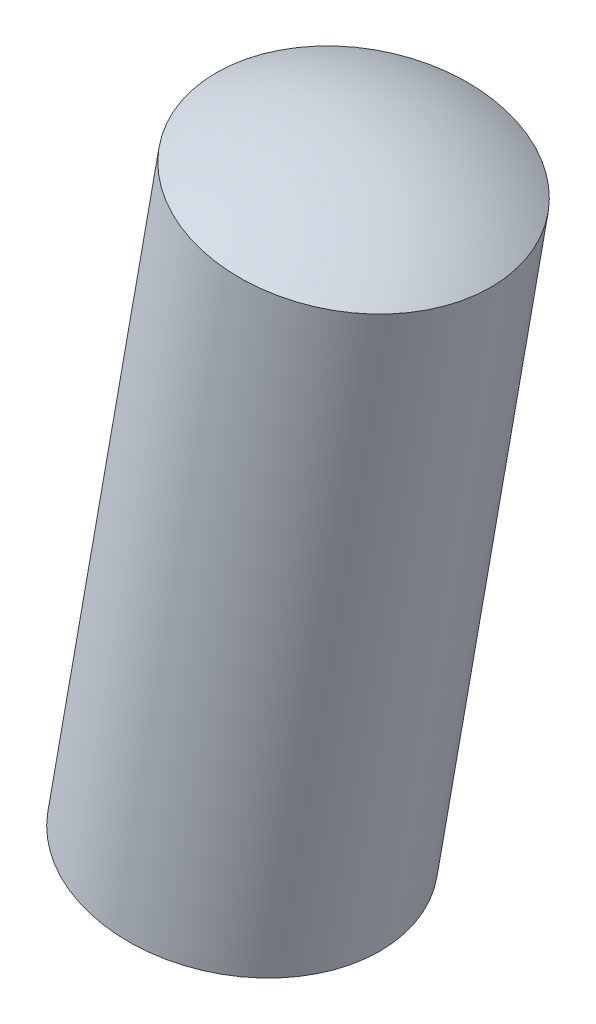
ISO-10303-21;
HEADER;
FILE_DESCRIPTION(('STEP AP214'),'2;1');
FILE_NAME('part.step','',(''),(''),'','','');
FILE_SCHEMA(('AUTOMOTIVE_DESIGN { 1 0 10303 214 1 1 1 1 }'));
ENDSEC;
DATA;
#1=APPLICATION_CONTEXT('core data for automotive mechanical design processes');
#2=APPLICATION_PROTOCOL_DEFINITION('international standard','automotive_design',2000,#1);
#3=PRODUCT_CONTEXT('',#1,'mechanical');
#4=PRODUCT('Part','Part','',(#3));
#5=PRODUCT_RELATED_PRODUCT_CATEGORY('part','',(#4));
#6=PRODUCT_DEFINITION_FORMATION('','',#4);
#7=PRODUCT_DEFINITION_CONTEXT('part definition',#1,'design');
#8=PRODUCT_DEFINITION('design','',#6,#7);
#9=PRODUCT_DEFINITION_SHAPE('','',#8);
#10=(LENGTH_UNIT() NAMED_UNIT(*) SI_UNIT(.MILLI.,.METRE.));
#11=(NAMED_UNIT(*) PLANE_ANGLE_UNIT() SI_UNIT($,.RADIAN.));
#12=(NAMED_UNIT(*) SI_UNIT($,.STERADIAN.) SOLID_ANGLE_UNIT());
#13=UNCERTAINTY_MEASURE_WITH_UNIT(LENGTH_MEASURE(1.E-05),#10,'distance_accuracy_value','');
#14=(GEOMETRIC_REPRESENTATION_CONTEXT(3) GLOBAL_UNCERTAINTY_ASSIGNED_CONTEXT((#13)) GLOBAL_UNIT_ASSIGNED_CONTEXT((#10,
#11,#12)) REPRESENTATION_CONTEXT('',''));
#15=CARTESIAN_POINT('',(0.,0.,0.));
#16=DIRECTION('',(0.,0.,1.));
#17=DIRECTION('',(1.,0.,0.));
#18=AXIS2_PLACEMENT_3D('',#15,#16,#17);
#19=CARTESIAN_POINT('',(3.87168311793416,21.9744800051858,0.6));
#20=DIRECTION('',(0.984830818000518,-0.173517318779514,0.));
#21=DIRECTION('',(0.173517318779515,0.984830818000517,0.));
#22=AXIS2_PLACEMENT_3D('',#19,#20,#21);
#23=SPHERICAL_SURFACE('',#22,2.);
#24=CARTESIAN_POINT('',(3.87168311793416,21.9744800051858,0.6));
#25=DIRECTION('',(-0.173517318779515,-0.984830818000518,0.));
#26=DIRECTION('',(0.,0.,-1.));
#27=AXIS2_PLACEMENT_3D('',#24,#25,#26);
#28=SPHERICAL_SURFACE('',#27,2.);
#29=CARTESIAN_POINT('',(4.17222393005341,23.6802570188223,0.6));
#30=DIRECTION('',(-0.173517318779515,-0.984830818000517,0.));
#31=DIRECTION('',(0.,0.,-1.));
#32=AXIS2_PLACEMENT_3D('',#29,#30,#31);
#33=CIRCLE('',#32,1.);
#34=CARTESIAN_POINT('',(4.17222393005341,23.6802570188223,-0.4));
#35=VERTEX_POINT('',#34);
#36=EDGE_CURVE('E11',#35,#35,#33,.T.);
#37=ORIENTED_EDGE('',*,*,#36,.F.);
#38=EDGE_LOOP('',(#37));
#39=FACE_BOUND('',#38,.T.);
#40=ADVANCED_FACE('F17',(#39),#28,.T.);
#41=CARTESIAN_POINT('',(3.67632024897473,20.8656605778366,0.6));
#42=DIRECTION('',(0.984830818000518,-0.173517318779514,0.));
#43=DIRECTION('',(-0.173517318779514,-0.984830818000518,0.));
#44=AXIS2_PLACEMENT_3D('',#41,#42,#43);
#45=SPHERICAL_SURFACE('',#44,2.);
#46=CARTESIAN_POINT('',(3.67632024897473,20.8656605778366,0.6));
#47=DIRECTION('',(-0.173517318779515,-0.984830818000518,0.));
#48=DIRECTION('',(0.,0.,-1.));
#49=AXIS2_PLACEMENT_3D('',#46,#47,#48);
#50=SPHERICAL_SURFACE('',#49,2.);
#51=CARTESIAN_POINT('',(3.37577943685548,19.1598835642001,0.6));
#52=DIRECTION('',(-0.173517318779515,-0.984830818000517,0.));
#53=DIRECTION('',(0.,0.,-1.));
#54=AXIS2_PLACEMENT_3D('',#51,#52,#53);
#55=CIRCLE('',#54,1.);
#56=CARTESIAN_POINT('',(3.37577943685548,19.1598835642001,-0.4));
#57=VERTEX_POINT('',#56);
#58=EDGE_CURVE('E21',#57,#57,#55,.T.);
#59=ORIENTED_EDGE('',*,*,#58,.T.);
#60=EDGE_LOOP('',(#59));
#61=FACE_BOUND('',#60,.T.);
#62=ADVANCED_FACE('F19',(#61),#50,.T.);
#63=CARTESIAN_POINT('',(3.57489056015493,20.2899769278558,0.6));
#64=DIRECTION('',(-0.173517318779515,-0.984830818000517,0.));
#65=DIRECTION('',(0.,0.,-1.));
#66=AXIS2_PLACEMENT_3D('',#63,#64,#65);
#67=CYLINDRICAL_SURFACE('',#66,1.);
#68=ORIENTED_EDGE('',*,*,#36,.T.);
#69=EDGE_LOOP('',(#68));
#70=FACE_BOUND('',#69,.T.);
#71=ORIENTED_EDGE('',*,*,#58,.F.);
#72=EDGE_LOOP('',(#71));
#73=FACE_BOUND('',#72,.T.);
#74=ADVANCED_FACE('F57',(#70,#73),#67,.T.);
#75=CLOSED_SHELL('',(#40,#62,#74));
#76=MANIFOLD_SOLID_BREP('B1',#75);
#77=ADVANCED_BREP_SHAPE_REPRESENTATION('',(#18,#76),#14);
#78=SHAPE_DEFINITION_REPRESENTATION(#9,#77);
ENDSEC;
END-ISO-10303-21;
